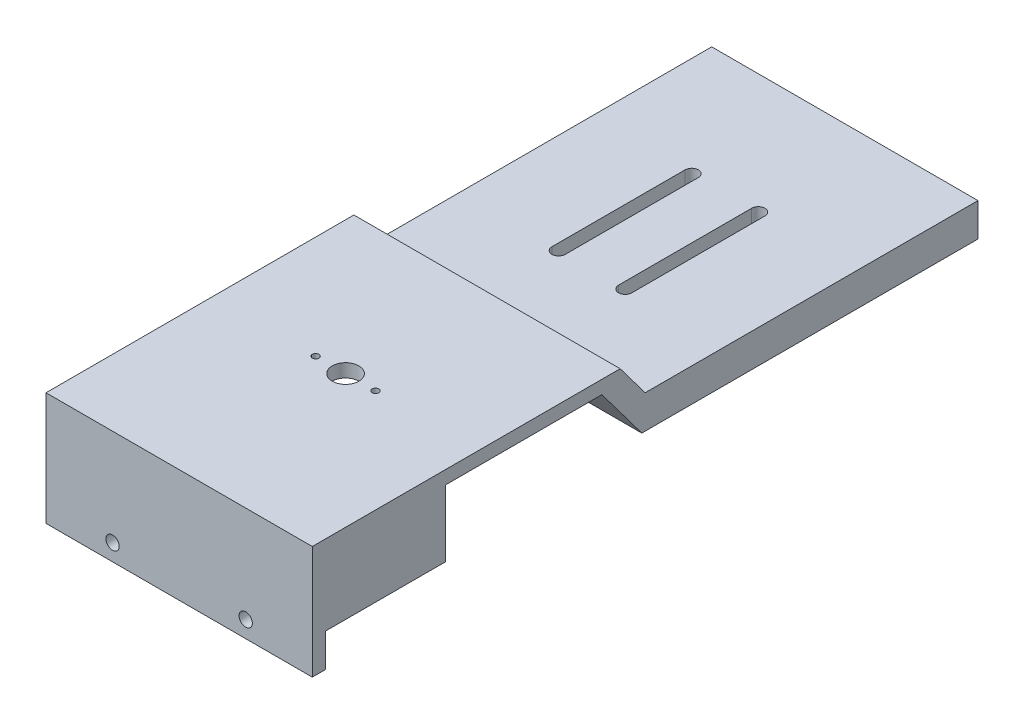
ISO-10303-21;
HEADER;
FILE_DESCRIPTION(('STEP AP214'),'2;1');
FILE_NAME('part.step','',(''),(''),'','','');
FILE_SCHEMA(('AUTOMOTIVE_DESIGN { 1 0 10303 214 1 1 1 1 }'));
ENDSEC;
DATA;
#1=APPLICATION_CONTEXT('core data for automotive mechanical design processes');
#2=APPLICATION_PROTOCOL_DEFINITION('international standard','automotive_design',2000,#1);
#3=PRODUCT_CONTEXT('',#1,'mechanical');
#4=PRODUCT('Part','Part','',(#3));
#5=PRODUCT_RELATED_PRODUCT_CATEGORY('part','',(#4));
#6=PRODUCT_DEFINITION_FORMATION('','',#4);
#7=PRODUCT_DEFINITION_CONTEXT('part definition',#1,'design');
#8=PRODUCT_DEFINITION('design','',#6,#7);
#9=PRODUCT_DEFINITION_SHAPE('','',#8);
#10=(LENGTH_UNIT() NAMED_UNIT(*) SI_UNIT(.MILLI.,.METRE.));
#11=(NAMED_UNIT(*) PLANE_ANGLE_UNIT() SI_UNIT($,.RADIAN.));
#12=(NAMED_UNIT(*) SI_UNIT($,.STERADIAN.) SOLID_ANGLE_UNIT());
#13=UNCERTAINTY_MEASURE_WITH_UNIT(LENGTH_MEASURE(1.E-05),#10,'distance_accuracy_value','');
#14=(GEOMETRIC_REPRESENTATION_CONTEXT(3) GLOBAL_UNCERTAINTY_ASSIGNED_CONTEXT((#13)) GLOBAL_UNIT_ASSIGNED_CONTEXT((#10,
#11,#12)) REPRESENTATION_CONTEXT('',''));
#15=CARTESIAN_POINT('',(0.,0.,0.));
#16=DIRECTION('',(0.,0.,1.));
#17=DIRECTION('',(1.,0.,0.));
#18=AXIS2_PLACEMENT_3D('',#15,#16,#17);
#19=CARTESIAN_POINT('',(-20.,-6.,20.));
#20=DIRECTION('',(0.,1.,0.));
#21=DIRECTION('',(0.,0.,1.));
#22=AXIS2_PLACEMENT_3D('',#19,#20,#21);
#23=PLANE('',#22);
#24=DIRECTION('',(1.,0.,0.));
#25=VECTOR('',#24,1.);
#26=CARTESIAN_POINT('',(-20.,-6.,18.));
#27=LINE('',#26,#25);
#28=CARTESIAN_POINT('',(-20.,-6.,18.));
#29=VERTEX_POINT('',#28);
#30=CARTESIAN_POINT('',(20.,-6.,18.));
#31=VERTEX_POINT('',#30);
#32=EDGE_CURVE('E346',#29,#31,#27,.T.);
#33=ORIENTED_EDGE('',*,*,#32,.F.);
#34=DIRECTION('',(0.,0.,-1.));
#35=VECTOR('',#34,1.);
#36=CARTESIAN_POINT('',(-20.,-6.,20.));
#37=LINE('',#36,#35);
#38=CARTESIAN_POINT('',(-20.,-6.,0.));
#39=VERTEX_POINT('',#38);
#40=EDGE_CURVE('E428',#29,#39,#37,.T.);
#41=ORIENTED_EDGE('',*,*,#40,.T.);
#42=DIRECTION('',(1.,0.,0.));
#43=VECTOR('',#42,1.);
#44=CARTESIAN_POINT('',(-20.,-6.,0.));
#45=LINE('',#44,#43);
#46=CARTESIAN_POINT('',(20.,-6.,0.));
#47=VERTEX_POINT('',#46);
#48=EDGE_CURVE('E409',#39,#47,#45,.T.);
#49=ORIENTED_EDGE('',*,*,#48,.T.);
#50=DIRECTION('',(0.,0.,-1.));
#51=VECTOR('',#50,1.);
#52=CARTESIAN_POINT('',(20.,-6.,20.));
#53=LINE('',#52,#51);
#54=EDGE_CURVE('E415',#31,#47,#53,.T.);
#55=ORIENTED_EDGE('',*,*,#54,.F.);
#56=EDGE_LOOP('',(#33,#41,#49,#55));
#57=FACE_BOUND('',#56,.T.);
#58=ADVANCED_FACE('F40',(#57),#23,.F.);
#59=CARTESIAN_POINT('',(0.,0.,0.));
#60=DIRECTION('',(0.,0.,1.));
#61=DIRECTION('',(1.,0.,0.));
#62=AXIS2_PLACEMENT_3D('',#59,#60,#61);
#63=PLANE('',#62);
#64=DIRECTION('',(-1.,0.,0.));
#65=VECTOR('',#64,1.);
#66=CARTESIAN_POINT('',(20.,4.,0.));
#67=LINE('',#66,#65);
#68=CARTESIAN_POINT('',(20.,4.,0.));
#69=VERTEX_POINT('',#68);
#70=CARTESIAN_POINT('',(-20.,4.,0.));
#71=VERTEX_POINT('',#70);
#72=EDGE_CURVE('E387',#69,#71,#67,.T.);
#73=ORIENTED_EDGE('',*,*,#72,.F.);
#74=DIRECTION('',(0.,1.,0.));
#75=VECTOR('',#74,1.);
#76=CARTESIAN_POINT('',(20.,6.,0.));
#77=LINE('',#76,#75);
#78=EDGE_CURVE('E403',#47,#69,#77,.T.);
#79=ORIENTED_EDGE('',*,*,#78,.F.);
#80=ORIENTED_EDGE('',*,*,#48,.F.);
#81=DIRECTION('',(0.,-1.,0.));
#82=VECTOR('',#81,1.);
#83=CARTESIAN_POINT('',(-20.,6.,0.));
#84=LINE('',#83,#82);
#85=EDGE_CURVE('E419',#71,#39,#84,.T.);
#86=ORIENTED_EDGE('',*,*,#85,.F.);
#87=EDGE_LOOP('',(#73,#79,#80,#86));
#88=FACE_BOUND('',#87,.T.);
#89=ADVANCED_FACE('F471',(#88),#63,.F.);
#90=CARTESIAN_POINT('',(20.,6.,20.));
#91=DIRECTION('',(-1.,0.,0.));
#92=DIRECTION('',(0.,-1.,0.));
#93=AXIS2_PLACEMENT_3D('',#90,#91,#92);
#94=PLANE('',#93);
#95=DIRECTION('',(0.,0.,-1.));
#96=VECTOR('',#95,1.);
#97=CARTESIAN_POINT('',(20.,0.999999999999989,-80.));
#98=LINE('',#97,#96);
#99=CARTESIAN_POINT('',(20.,0.999999999999989,-30.));
#100=VERTEX_POINT('',#99);
#101=CARTESIAN_POINT('',(20.,0.999999999999973,-80.));
#102=VERTEX_POINT('',#101);
#103=EDGE_CURVE('E270',#100,#102,#98,.T.);
#104=ORIENTED_EDGE('',*,*,#103,.F.);
#105=DIRECTION('',(0.,-0.800000000000001,-0.599999999999999));
#106=VECTOR('',#105,1.);
#107=CARTESIAN_POINT('',(20.,0.999999999999969,-30.));
#108=LINE('',#107,#106);
#109=CARTESIAN_POINT('',(20.,6.,-26.25));
#110=VERTEX_POINT('',#109);
#111=EDGE_CURVE('E273',#110,#100,#108,.T.);
#112=ORIENTED_EDGE('',*,*,#111,.F.);
#113=DIRECTION('',(0.,0.,-1.));
#114=VECTOR('',#113,1.);
#115=CARTESIAN_POINT('',(20.,6.,20.));
#116=LINE('',#115,#114);
#117=CARTESIAN_POINT('',(20.,6.,20.));
#118=VERTEX_POINT('',#117);
#119=EDGE_CURVE('E11',#118,#110,#116,.T.);
#120=ORIENTED_EDGE('',*,*,#119,.F.);
#121=DIRECTION('',(0.,1.,0.));
#122=VECTOR('',#121,1.);
#123=CARTESIAN_POINT('',(20.,6.,20.));
#124=LINE('',#123,#122);
#125=CARTESIAN_POINT('',(20.,-11.,20.));
#126=VERTEX_POINT('',#125);
#127=EDGE_CURVE('E404',#126,#118,#124,.T.);
#128=ORIENTED_EDGE('',*,*,#127,.F.);
#129=DIRECTION('',(0.,0.,1.));
#130=VECTOR('',#129,1.);
#131=CARTESIAN_POINT('',(20.,-11.,20.));
#132=LINE('',#131,#130);
#133=CARTESIAN_POINT('',(20.,-11.,18.));
#134=VERTEX_POINT('',#133);
#135=EDGE_CURVE('E368',#134,#126,#132,.T.);
#136=ORIENTED_EDGE('',*,*,#135,.F.);
#137=DIRECTION('',(0.,1.,0.));
#138=VECTOR('',#137,1.);
#139=CARTESIAN_POINT('',(20.,-11.,18.));
#140=LINE('',#139,#138);
#141=EDGE_CURVE('E376',#134,#31,#140,.T.);
#142=ORIENTED_EDGE('',*,*,#141,.T.);
#143=ORIENTED_EDGE('',*,*,#54,.T.);
#144=ORIENTED_EDGE('',*,*,#78,.T.);
#145=DIRECTION('',(0.,0.,1.));
#146=VECTOR('',#145,1.);
#147=CARTESIAN_POINT('',(20.,4.,-23.5));
#148=LINE('',#147,#146);
#149=CARTESIAN_POINT('',(20.,4.,-23.5));
#150=VERTEX_POINT('',#149);
#151=EDGE_CURVE('E399',#150,#69,#148,.T.);
#152=ORIENTED_EDGE('',*,*,#151,.F.);
#153=DIRECTION('',(0.,-0.8,-0.6));
#154=VECTOR('',#153,1.);
#155=CARTESIAN_POINT('',(20.,4.,-23.5));
#156=LINE('',#155,#154);
#157=CARTESIAN_POINT('',(20.,-4.,-29.5));
#158=VERTEX_POINT('',#157);
#159=EDGE_CURVE('E277',#150,#158,#156,.T.);
#160=ORIENTED_EDGE('',*,*,#159,.T.);
#161=DIRECTION('',(0.,0.,-1.));
#162=VECTOR('',#161,1.);
#163=CARTESIAN_POINT('',(20.,-4.,-29.5));
#164=LINE('',#163,#162);
#165=CARTESIAN_POINT('',(20.,-4.,-80.));
#166=VERTEX_POINT('',#165);
#167=EDGE_CURVE('E304',#158,#166,#164,.T.);
#168=ORIENTED_EDGE('',*,*,#167,.T.);
#169=DIRECTION('',(0.,1.,0.));
#170=VECTOR('',#169,1.);
#171=CARTESIAN_POINT('',(20.,6.,-80.));
#172=LINE('',#171,#170);
#173=EDGE_CURVE('E308',#166,#102,#172,.T.);
#174=ORIENTED_EDGE('',*,*,#173,.T.);
#175=EDGE_LOOP('',(#104,#112,#120,#128,#136,#142,#143,#144,#152,#160,#168,#174));
#176=FACE_BOUND('',#175,.T.);
#177=ADVANCED_FACE('F42',(#176),#94,.F.);
#178=CARTESIAN_POINT('',(-20.,6.,20.));
#179=DIRECTION('',(0.,-1.,0.));
#180=DIRECTION('',(0.,0.,-1.));
#181=AXIS2_PLACEMENT_3D('',#178,#179,#180);
#182=PLANE('',#181);
#183=CARTESIAN_POINT('',(-4.5,6.,-5.));
#184=DIRECTION('',(0.,1.,0.));
#185=DIRECTION('',(0.,0.,1.));
#186=AXIS2_PLACEMENT_3D('',#183,#184,#185);
#187=CIRCLE('',#186,0.500000000000001);
#188=CARTESIAN_POINT('',(-4.5,6.,-4.5));
#189=VERTEX_POINT('',#188);
#190=EDGE_CURVE('E337',#189,#189,#187,.T.);
#191=ORIENTED_EDGE('',*,*,#190,.F.);
#192=EDGE_LOOP('',(#191));
#193=FACE_BOUND('',#192,.T.);
#194=CARTESIAN_POINT('',(4.49999999999996,6.,-5.00000000000003));
#195=DIRECTION('',(0.,1.,0.));
#196=DIRECTION('',(0.,0.,-1.));
#197=AXIS2_PLACEMENT_3D('',#194,#195,#196);
#198=CIRCLE('',#197,0.5);
#199=CARTESIAN_POINT('',(4.49999999999996,6.,-5.50000000000003));
#200=VERTEX_POINT('',#199);
#201=EDGE_CURVE('E347',#200,#200,#198,.T.);
#202=ORIENTED_EDGE('',*,*,#201,.F.);
#203=EDGE_LOOP('',(#202));
#204=FACE_BOUND('',#203,.T.);
#205=CARTESIAN_POINT('',(0.,6.,-5.00000000000002));
#206=DIRECTION('',(0.,1.,0.));
#207=DIRECTION('',(0.,0.,1.));
#208=AXIS2_PLACEMENT_3D('',#205,#206,#207);
#209=CIRCLE('',#208,2.);
#210=CARTESIAN_POINT('',(0.,6.,-3.00000000000002));
#211=VERTEX_POINT('',#210);
#212=EDGE_CURVE('E325',#211,#211,#209,.T.);
#213=ORIENTED_EDGE('',*,*,#212,.F.);
#214=EDGE_LOOP('',(#213));
#215=FACE_BOUND('',#214,.T.);
#216=ORIENTED_EDGE('',*,*,#119,.T.);
#217=DIRECTION('',(-1.,0.,0.));
#218=VECTOR('',#217,1.);
#219=CARTESIAN_POINT('',(73.982057204223,5.99999999999997,-26.25));
#220=LINE('',#219,#218);
#221=CARTESIAN_POINT('',(-20.,6.,-26.25));
#222=VERTEX_POINT('',#221);
#223=EDGE_CURVE('E274',#110,#222,#220,.T.);
#224=ORIENTED_EDGE('',*,*,#223,.T.);
#225=DIRECTION('',(0.,0.,-1.));
#226=VECTOR('',#225,1.);
#227=CARTESIAN_POINT('',(-20.,6.,20.));
#228=LINE('',#227,#226);
#229=CARTESIAN_POINT('',(-20.,6.,20.));
#230=VERTEX_POINT('',#229);
#231=EDGE_CURVE('E49',#230,#222,#228,.T.);
#232=ORIENTED_EDGE('',*,*,#231,.F.);
#233=DIRECTION('',(-1.,0.,0.));
#234=VECTOR('',#233,1.);
#235=CARTESIAN_POINT('',(-20.,6.,20.));
#236=LINE('',#235,#234);
#237=EDGE_CURVE('E408',#118,#230,#236,.T.);
#238=ORIENTED_EDGE('',*,*,#237,.F.);
#239=EDGE_LOOP('',(#216,#224,#232,#238));
#240=FACE_BOUND('',#239,.T.);
#241=ADVANCED_FACE('F440',(#193,#204,#215,#240),#182,.F.);
#242=CARTESIAN_POINT('',(-20.,6.,20.));
#243=DIRECTION('',(1.,0.,0.));
#244=DIRECTION('',(0.,1.,0.));
#245=AXIS2_PLACEMENT_3D('',#242,#243,#244);
#246=PLANE('',#245);
#247=ORIENTED_EDGE('',*,*,#231,.T.);
#248=DIRECTION('',(0.,0.800000000000001,0.599999999999999));
#249=VECTOR('',#248,1.);
#250=CARTESIAN_POINT('',(-20.,1.,-30.));
#251=LINE('',#250,#249);
#252=CARTESIAN_POINT('',(-20.,1.,-30.));
#253=VERTEX_POINT('',#252);
#254=EDGE_CURVE('E281',#253,#222,#251,.T.);
#255=ORIENTED_EDGE('',*,*,#254,.F.);
#256=DIRECTION('',(0.,0.,1.));
#257=VECTOR('',#256,1.);
#258=CARTESIAN_POINT('',(-20.,1.,-80.));
#259=LINE('',#258,#257);
#260=CARTESIAN_POINT('',(-20.,1.,-80.));
#261=VERTEX_POINT('',#260);
#262=EDGE_CURVE('E186',#261,#253,#259,.T.);
#263=ORIENTED_EDGE('',*,*,#262,.F.);
#264=DIRECTION('',(0.,-1.,0.));
#265=VECTOR('',#264,1.);
#266=CARTESIAN_POINT('',(-20.,5.99999999999996,-80.));
#267=LINE('',#266,#265);
#268=CARTESIAN_POINT('',(-20.,-4.00000000000001,-80.));
#269=VERTEX_POINT('',#268);
#270=EDGE_CURVE('E296',#261,#269,#267,.T.);
#271=ORIENTED_EDGE('',*,*,#270,.T.);
#272=DIRECTION('',(0.,0.,1.));
#273=VECTOR('',#272,1.);
#274=CARTESIAN_POINT('',(-20.,-4.00000000000001,-29.5));
#275=LINE('',#274,#273);
#276=CARTESIAN_POINT('',(-20.,-4.00000000000001,-29.5));
#277=VERTEX_POINT('',#276);
#278=EDGE_CURVE('E293',#269,#277,#275,.T.);
#279=ORIENTED_EDGE('',*,*,#278,.T.);
#280=DIRECTION('',(0.,0.8,0.6));
#281=VECTOR('',#280,1.);
#282=CARTESIAN_POINT('',(-20.,3.99999999999997,-23.5));
#283=LINE('',#282,#281);
#284=CARTESIAN_POINT('',(-20.,4.,-23.5));
#285=VERTEX_POINT('',#284);
#286=EDGE_CURVE('E300',#277,#285,#283,.T.);
#287=ORIENTED_EDGE('',*,*,#286,.T.);
#288=DIRECTION('',(0.,0.,1.));
#289=VECTOR('',#288,1.);
#290=CARTESIAN_POINT('',(-20.,4.,-23.5));
#291=LINE('',#290,#289);
#292=EDGE_CURVE('E392',#285,#71,#291,.T.);
#293=ORIENTED_EDGE('',*,*,#292,.T.);
#294=ORIENTED_EDGE('',*,*,#85,.T.);
#295=ORIENTED_EDGE('',*,*,#40,.F.);
#296=DIRECTION('',(0.,1.,0.));
#297=VECTOR('',#296,1.);
#298=CARTESIAN_POINT('',(-20.,-11.,18.));
#299=LINE('',#298,#297);
#300=CARTESIAN_POINT('',(-20.,-11.,18.));
#301=VERTEX_POINT('',#300);
#302=EDGE_CURVE('E383',#301,#29,#299,.T.);
#303=ORIENTED_EDGE('',*,*,#302,.F.);
#304=DIRECTION('',(0.,0.,-1.));
#305=VECTOR('',#304,1.);
#306=CARTESIAN_POINT('',(-20.,-11.,20.));
#307=LINE('',#306,#305);
#308=CARTESIAN_POINT('',(-20.,-11.,20.));
#309=VERTEX_POINT('',#308);
#310=EDGE_CURVE('E361',#309,#301,#307,.T.);
#311=ORIENTED_EDGE('',*,*,#310,.F.);
#312=DIRECTION('',(0.,-1.,0.));
#313=VECTOR('',#312,1.);
#314=CARTESIAN_POINT('',(-20.,6.,20.));
#315=LINE('',#314,#313);
#316=EDGE_CURVE('E412',#230,#309,#315,.T.);
#317=ORIENTED_EDGE('',*,*,#316,.F.);
#318=EDGE_LOOP('',(#247,#255,#263,#271,#279,#287,#293,#294,#295,#303,#311,#317));
#319=FACE_BOUND('',#318,.T.);
#320=ADVANCED_FACE('F436',(#319),#246,.F.);
#321=CARTESIAN_POINT('',(0.,0.,20.));
#322=DIRECTION('',(0.,0.,1.));
#323=DIRECTION('',(1.,0.,0.));
#324=AXIS2_PLACEMENT_3D('',#321,#322,#323);
#325=PLANE('',#324);
#326=CARTESIAN_POINT('',(10.,-8.5,20.));
#327=DIRECTION('',(0.,0.,1.));
#328=DIRECTION('',(1.,0.,0.));
#329=AXIS2_PLACEMENT_3D('',#326,#327,#328);
#330=CIRCLE('',#329,1.);
#331=CARTESIAN_POINT('',(11.,-8.5,20.));
#332=VERTEX_POINT('',#331);
#333=EDGE_CURVE('E326',#332,#332,#330,.F.);
#334=ORIENTED_EDGE('',*,*,#333,.T.);
#335=EDGE_LOOP('',(#334));
#336=FACE_BOUND('',#335,.T.);
#337=CARTESIAN_POINT('',(-10.0000000000001,-8.49999999999993,20.));
#338=DIRECTION('',(0.,0.,1.));
#339=DIRECTION('',(1.,0.,0.));
#340=AXIS2_PLACEMENT_3D('',#337,#338,#339);
#341=CIRCLE('',#340,1.);
#342=CARTESIAN_POINT('',(-9.00000000000006,-8.49999999999993,20.));
#343=VERTEX_POINT('',#342);
#344=EDGE_CURVE('E320',#343,#343,#341,.F.);
#345=ORIENTED_EDGE('',*,*,#344,.T.);
#346=EDGE_LOOP('',(#345));
#347=FACE_BOUND('',#346,.T.);
#348=ORIENTED_EDGE('',*,*,#127,.T.);
#349=ORIENTED_EDGE('',*,*,#237,.T.);
#350=ORIENTED_EDGE('',*,*,#316,.T.);
#351=DIRECTION('',(-1.,0.,0.));
#352=VECTOR('',#351,1.);
#353=CARTESIAN_POINT('',(-20.,-11.,20.));
#354=LINE('',#353,#352);
#355=EDGE_CURVE('E372',#126,#309,#354,.T.);
#356=ORIENTED_EDGE('',*,*,#355,.F.);
#357=EDGE_LOOP('',(#348,#349,#350,#356));
#358=FACE_BOUND('',#357,.T.);
#359=ADVANCED_FACE('F482',(#336,#347,#358),#325,.T.);
#360=CARTESIAN_POINT('',(20.,4.,-23.5));
#361=DIRECTION('',(0.,1.,0.));
#362=DIRECTION('',(0.,0.,1.));
#363=AXIS2_PLACEMENT_3D('',#360,#361,#362);
#364=PLANE('',#363);
#365=CARTESIAN_POINT('',(-4.5,4.,-5.));
#366=DIRECTION('',(0.,1.,0.));
#367=DIRECTION('',(0.,0.,1.));
#368=AXIS2_PLACEMENT_3D('',#365,#366,#367);
#369=CIRCLE('',#368,0.500000000000001);
#370=CARTESIAN_POINT('',(-4.5,4.,-4.5));
#371=VERTEX_POINT('',#370);
#372=EDGE_CURVE('E341',#371,#371,#369,.F.);
#373=ORIENTED_EDGE('',*,*,#372,.F.);
#374=EDGE_LOOP('',(#373));
#375=FACE_BOUND('',#374,.T.);
#376=CARTESIAN_POINT('',(4.49999999999996,4.,-5.00000000000003));
#377=DIRECTION('',(0.,1.,0.));
#378=DIRECTION('',(0.,0.,1.));
#379=AXIS2_PLACEMENT_3D('',#376,#377,#378);
#380=CIRCLE('',#379,0.5);
#381=CARTESIAN_POINT('',(4.49999999999996,4.,-4.50000000000003));
#382=VERTEX_POINT('',#381);
#383=EDGE_CURVE('E342',#382,#382,#380,.F.);
#384=ORIENTED_EDGE('',*,*,#383,.F.);
#385=EDGE_LOOP('',(#384));
#386=FACE_BOUND('',#385,.T.);
#387=CARTESIAN_POINT('',(0.,4.,-5.00000000000002));
#388=DIRECTION('',(0.,1.,0.));
#389=DIRECTION('',(0.,0.,1.));
#390=AXIS2_PLACEMENT_3D('',#387,#388,#389);
#391=CIRCLE('',#390,2.);
#392=CARTESIAN_POINT('',(0.,4.,-3.00000000000002));
#393=VERTEX_POINT('',#392);
#394=EDGE_CURVE('E351',#393,#393,#391,.F.);
#395=ORIENTED_EDGE('',*,*,#394,.F.);
#396=EDGE_LOOP('',(#395));
#397=FACE_BOUND('',#396,.T.);
#398=ORIENTED_EDGE('',*,*,#72,.T.);
#399=ORIENTED_EDGE('',*,*,#292,.F.);
#400=DIRECTION('',(-1.,0.,0.));
#401=VECTOR('',#400,1.);
#402=CARTESIAN_POINT('',(20.,4.,-23.5));
#403=LINE('',#402,#401);
#404=EDGE_CURVE('E388',#150,#285,#403,.T.);
#405=ORIENTED_EDGE('',*,*,#404,.F.);
#406=ORIENTED_EDGE('',*,*,#151,.T.);
#407=EDGE_LOOP('',(#398,#399,#405,#406));
#408=FACE_BOUND('',#407,.T.);
#409=ADVANCED_FACE('F467',(#375,#386,#397,#408),#364,.F.);
#410=CARTESIAN_POINT('',(-20.,-11.,18.));
#411=DIRECTION('',(0.,0.,1.));
#412=DIRECTION('',(1.,0.,0.));
#413=AXIS2_PLACEMENT_3D('',#410,#411,#412);
#414=PLANE('',#413);
#415=CARTESIAN_POINT('',(10.,-8.5,18.));
#416=DIRECTION('',(0.,0.,-1.));
#417=DIRECTION('',(-1.,0.,0.));
#418=AXIS2_PLACEMENT_3D('',#415,#416,#417);
#419=CIRCLE('',#418,1.);
#420=CARTESIAN_POINT('',(9.,-8.5,18.));
#421=VERTEX_POINT('',#420);
#422=EDGE_CURVE('E321',#421,#421,#419,.T.);
#423=ORIENTED_EDGE('',*,*,#422,.F.);
#424=EDGE_LOOP('',(#423));
#425=FACE_BOUND('',#424,.T.);
#426=CARTESIAN_POINT('',(-10.0000000000001,-8.49999999999993,18.));
#427=DIRECTION('',(0.,0.,-1.));
#428=DIRECTION('',(1.,0.,0.));
#429=AXIS2_PLACEMENT_3D('',#426,#427,#428);
#430=CIRCLE('',#429,1.);
#431=CARTESIAN_POINT('',(-9.00000000000006,-8.49999999999993,18.));
#432=VERTEX_POINT('',#431);
#433=EDGE_CURVE('E330',#432,#432,#430,.T.);
#434=ORIENTED_EDGE('',*,*,#433,.F.);
#435=EDGE_LOOP('',(#434));
#436=FACE_BOUND('',#435,.T.);
#437=ORIENTED_EDGE('',*,*,#32,.T.);
#438=ORIENTED_EDGE('',*,*,#141,.F.);
#439=DIRECTION('',(1.,0.,0.));
#440=VECTOR('',#439,1.);
#441=CARTESIAN_POINT('',(-20.,-11.,18.));
#442=LINE('',#441,#440);
#443=EDGE_CURVE('E365',#301,#134,#442,.T.);
#444=ORIENTED_EDGE('',*,*,#443,.F.);
#445=ORIENTED_EDGE('',*,*,#302,.T.);
#446=EDGE_LOOP('',(#437,#438,#444,#445));
#447=FACE_BOUND('',#446,.T.);
#448=ADVANCED_FACE('F477',(#425,#436,#447),#414,.F.);
#449=CARTESIAN_POINT('',(0.,-11.,0.));
#450=DIRECTION('',(0.,-1.,0.));
#451=DIRECTION('',(0.,0.,-1.));
#452=AXIS2_PLACEMENT_3D('',#449,#450,#451);
#453=PLANE('',#452);
#454=ORIENTED_EDGE('',*,*,#310,.T.);
#455=ORIENTED_EDGE('',*,*,#443,.T.);
#456=ORIENTED_EDGE('',*,*,#135,.T.);
#457=ORIENTED_EDGE('',*,*,#355,.T.);
#458=EDGE_LOOP('',(#454,#455,#456,#457));
#459=FACE_BOUND('',#458,.T.);
#460=ADVANCED_FACE('F479',(#459),#453,.T.);
#461=CARTESIAN_POINT('',(0.,-11.001,-5.00000000000002));
#462=DIRECTION('',(0.,1.,0.));
#463=DIRECTION('',(0.,0.,1.));
#464=AXIS2_PLACEMENT_3D('',#461,#462,#463);
#465=CYLINDRICAL_SURFACE('',#464,2.);
#466=ORIENTED_EDGE('',*,*,#212,.T.);
#467=EDGE_LOOP('',(#466));
#468=FACE_BOUND('',#467,.T.);
#469=ORIENTED_EDGE('',*,*,#394,.T.);
#470=EDGE_LOOP('',(#469));
#471=FACE_BOUND('',#470,.T.);
#472=ADVANCED_FACE('F512',(#468,#471),#465,.F.);
#473=CARTESIAN_POINT('',(4.49999999999996,-11.001,-5.00000000000003));
#474=DIRECTION('',(0.,1.,0.));
#475=DIRECTION('',(0.,0.,1.));
#476=AXIS2_PLACEMENT_3D('',#473,#474,#475);
#477=CYLINDRICAL_SURFACE('',#476,0.5);
#478=ORIENTED_EDGE('',*,*,#201,.T.);
#479=EDGE_LOOP('',(#478));
#480=FACE_BOUND('',#479,.T.);
#481=ORIENTED_EDGE('',*,*,#383,.T.);
#482=EDGE_LOOP('',(#481));
#483=FACE_BOUND('',#482,.T.);
#484=ADVANCED_FACE('F515',(#480,#483),#477,.F.);
#485=CARTESIAN_POINT('',(-4.5,-11.001,-5.));
#486=DIRECTION('',(0.,1.,0.));
#487=DIRECTION('',(0.,0.,1.));
#488=AXIS2_PLACEMENT_3D('',#485,#486,#487);
#489=CYLINDRICAL_SURFACE('',#488,0.500000000000001);
#490=ORIENTED_EDGE('',*,*,#190,.T.);
#491=EDGE_LOOP('',(#490));
#492=FACE_BOUND('',#491,.T.);
#493=ORIENTED_EDGE('',*,*,#372,.T.);
#494=EDGE_LOOP('',(#493));
#495=FACE_BOUND('',#494,.T.);
#496=ADVANCED_FACE('F523',(#492,#495),#489,.F.);
#497=CARTESIAN_POINT('',(-10.0000000000001,-8.49999999999993,20.001));
#498=DIRECTION('',(0.,0.,-1.));
#499=DIRECTION('',(-1.,0.,0.));
#500=AXIS2_PLACEMENT_3D('',#497,#498,#499);
#501=CYLINDRICAL_SURFACE('',#500,1.);
#502=ORIENTED_EDGE('',*,*,#344,.F.);
#503=EDGE_LOOP('',(#502));
#504=FACE_BOUND('',#503,.T.);
#505=ORIENTED_EDGE('',*,*,#433,.T.);
#506=EDGE_LOOP('',(#505));
#507=FACE_BOUND('',#506,.T.);
#508=ADVANCED_FACE('F537',(#504,#507),#501,.F.);
#509=CARTESIAN_POINT('',(10.,-8.5,20.001));
#510=DIRECTION('',(0.,0.,-1.));
#511=DIRECTION('',(-1.,0.,0.));
#512=AXIS2_PLACEMENT_3D('',#509,#510,#511);
#513=CYLINDRICAL_SURFACE('',#512,1.);
#514=ORIENTED_EDGE('',*,*,#333,.F.);
#515=EDGE_LOOP('',(#514));
#516=FACE_BOUND('',#515,.T.);
#517=ORIENTED_EDGE('',*,*,#422,.T.);
#518=EDGE_LOOP('',(#517));
#519=FACE_BOUND('',#518,.T.);
#520=ADVANCED_FACE('F539',(#516,#519),#513,.F.);
#521=CARTESIAN_POINT('',(-77.3781317228088,5.99999999999997,-80.));
#522=DIRECTION('',(0.,0.,-1.));
#523=DIRECTION('',(-1.,0.,0.));
#524=AXIS2_PLACEMENT_3D('',#521,#522,#523);
#525=PLANE('',#524);
#526=DIRECTION('',(-1.,0.,0.));
#527=VECTOR('',#526,1.);
#528=CARTESIAN_POINT('',(73.982057204223,0.999999999999974,-80.));
#529=LINE('',#528,#527);
#530=EDGE_CURVE('E284',#102,#261,#529,.T.);
#531=ORIENTED_EDGE('',*,*,#530,.F.);
#532=ORIENTED_EDGE('',*,*,#173,.F.);
#533=DIRECTION('',(1.,0.,0.));
#534=VECTOR('',#533,1.);
#535=CARTESIAN_POINT('',(-77.3781317228088,-4.00000000000003,-80.));
#536=LINE('',#535,#534);
#537=EDGE_CURVE('E297',#269,#166,#536,.T.);
#538=ORIENTED_EDGE('',*,*,#537,.F.);
#539=ORIENTED_EDGE('',*,*,#270,.F.);
#540=EDGE_LOOP('',(#531,#532,#538,#539));
#541=FACE_BOUND('',#540,.T.);
#542=ADVANCED_FACE('F454',(#541),#525,.T.);
#543=CARTESIAN_POINT('',(-77.3781317228088,-4.00000000000003,-29.5));
#544=DIRECTION('',(0.,-1.,0.));
#545=DIRECTION('',(1.,0.,0.));
#546=AXIS2_PLACEMENT_3D('',#543,#544,#545);
#547=PLANE('',#546);
#548=CARTESIAN_POINT('',(-5.,-4.00000000000001,-62.));
#549=DIRECTION('',(0.,-1.,0.));
#550=DIRECTION('',(1.,0.,0.));
#551=AXIS2_PLACEMENT_3D('',#548,#549,#550);
#552=CIRCLE('',#551,1.);
#553=CARTESIAN_POINT('',(-4.,-4.00000000000001,-62.));
#554=VERTEX_POINT('',#553);
#555=CARTESIAN_POINT('',(-6.,-4.00000000000001,-62.));
#556=VERTEX_POINT('',#555);
#557=EDGE_CURVE('E191',#554,#556,#552,.F.);
#558=ORIENTED_EDGE('',*,*,#557,.T.);
#559=DIRECTION('',(0.,0.,1.));
#560=VECTOR('',#559,1.);
#561=CARTESIAN_POINT('',(-6.,-4.00000000000001,-62.));
#562=LINE('',#561,#560);
#563=CARTESIAN_POINT('',(-6.00000000000001,-4.00000000000001,-42.));
#564=VERTEX_POINT('',#563);
#565=EDGE_CURVE('E177',#556,#564,#562,.T.);
#566=ORIENTED_EDGE('',*,*,#565,.T.);
#567=CARTESIAN_POINT('',(-5.,-4.00000000000001,-42.));
#568=DIRECTION('',(0.,-1.,0.));
#569=DIRECTION('',(1.,0.,0.));
#570=AXIS2_PLACEMENT_3D('',#567,#568,#569);
#571=CIRCLE('',#570,1.);
#572=CARTESIAN_POINT('',(-4.,-4.00000000000001,-42.));
#573=VERTEX_POINT('',#572);
#574=EDGE_CURVE('E208',#564,#573,#571,.F.);
#575=ORIENTED_EDGE('',*,*,#574,.T.);
#576=DIRECTION('',(0.,0.,-1.));
#577=VECTOR('',#576,1.);
#578=CARTESIAN_POINT('',(-4.,-4.00000000000001,-62.));
#579=LINE('',#578,#577);
#580=EDGE_CURVE('E201',#573,#554,#579,.T.);
#581=ORIENTED_EDGE('',*,*,#580,.T.);
#582=EDGE_LOOP('',(#558,#566,#575,#581));
#583=FACE_BOUND('',#582,.T.);
#584=CARTESIAN_POINT('',(5.00000000000011,-4.,-62.));
#585=DIRECTION('',(0.,-1.,0.));
#586=DIRECTION('',(1.,0.,0.));
#587=AXIS2_PLACEMENT_3D('',#584,#585,#586);
#588=CIRCLE('',#587,1.);
#589=CARTESIAN_POINT('',(6.00000000000011,-4.,-62.));
#590=VERTEX_POINT('',#589);
#591=CARTESIAN_POINT('',(4.00000000000011,-4.,-62.));
#592=VERTEX_POINT('',#591);
#593=EDGE_CURVE('E236',#590,#592,#588,.F.);
#594=ORIENTED_EDGE('',*,*,#593,.T.);
#595=DIRECTION('',(0.,0.,1.));
#596=VECTOR('',#595,1.);
#597=CARTESIAN_POINT('',(4.00000000000011,-4.,-62.));
#598=LINE('',#597,#596);
#599=CARTESIAN_POINT('',(4.00000000000025,-4.,-42.));
#600=VERTEX_POINT('',#599);
#601=EDGE_CURVE('E258',#592,#600,#598,.T.);
#602=ORIENTED_EDGE('',*,*,#601,.T.);
#603=CARTESIAN_POINT('',(5.00000000000025,-4.,-42.));
#604=DIRECTION('',(0.,-1.,0.));
#605=DIRECTION('',(1.,0.,0.));
#606=AXIS2_PLACEMENT_3D('',#603,#604,#605);
#607=CIRCLE('',#606,1.);
#608=CARTESIAN_POINT('',(6.00000000000025,-4.,-42.));
#609=VERTEX_POINT('',#608);
#610=EDGE_CURVE('E228',#600,#609,#607,.F.);
#611=ORIENTED_EDGE('',*,*,#610,.T.);
#612=DIRECTION('',(0.,0.,-1.));
#613=VECTOR('',#612,1.);
#614=CARTESIAN_POINT('',(6.00000000000011,-4.,-62.));
#615=LINE('',#614,#613);
#616=EDGE_CURVE('E232',#609,#590,#615,.T.);
#617=ORIENTED_EDGE('',*,*,#616,.T.);
#618=EDGE_LOOP('',(#594,#602,#611,#617));
#619=FACE_BOUND('',#618,.T.);
#620=ORIENTED_EDGE('',*,*,#278,.F.);
#621=ORIENTED_EDGE('',*,*,#537,.T.);
#622=ORIENTED_EDGE('',*,*,#167,.F.);
#623=DIRECTION('',(1.,0.,0.));
#624=VECTOR('',#623,1.);
#625=CARTESIAN_POINT('',(-77.3781317228088,-4.00000000000003,-29.5));
#626=LINE('',#625,#624);
#627=EDGE_CURVE('E312',#277,#158,#626,.T.);
#628=ORIENTED_EDGE('',*,*,#627,.F.);
#629=EDGE_LOOP('',(#620,#621,#622,#628));
#630=FACE_BOUND('',#629,.T.);
#631=ADVANCED_FACE('F199',(#583,#619,#630),#547,.T.);
#632=CARTESIAN_POINT('',(-77.3781317228088,3.99999999999997,-23.5));
#633=DIRECTION('',(0.,-0.6,0.8));
#634=DIRECTION('',(0.,-0.8,-0.6));
#635=AXIS2_PLACEMENT_3D('',#632,#633,#634);
#636=PLANE('',#635);
#637=ORIENTED_EDGE('',*,*,#286,.F.);
#638=ORIENTED_EDGE('',*,*,#627,.T.);
#639=ORIENTED_EDGE('',*,*,#159,.F.);
#640=ORIENTED_EDGE('',*,*,#404,.T.);
#641=EDGE_LOOP('',(#637,#638,#639,#640));
#642=FACE_BOUND('',#641,.T.);
#643=ADVANCED_FACE('F463',(#642),#636,.T.);
#644=CARTESIAN_POINT('',(73.982057204223,0.999999999999974,-30.));
#645=DIRECTION('',(0.,-0.599999999999999,0.800000000000001));
#646=DIRECTION('',(0.,-0.800000000000001,-0.599999999999999));
#647=AXIS2_PLACEMENT_3D('',#644,#645,#646);
#648=PLANE('',#647);
#649=ORIENTED_EDGE('',*,*,#111,.T.);
#650=DIRECTION('',(-1.,0.,0.));
#651=VECTOR('',#650,1.);
#652=CARTESIAN_POINT('',(73.982057204223,0.999999999999974,-30.));
#653=LINE('',#652,#651);
#654=EDGE_CURVE('E288',#100,#253,#653,.T.);
#655=ORIENTED_EDGE('',*,*,#654,.T.);
#656=ORIENTED_EDGE('',*,*,#254,.T.);
#657=ORIENTED_EDGE('',*,*,#223,.F.);
#658=EDGE_LOOP('',(#649,#655,#656,#657));
#659=FACE_BOUND('',#658,.T.);
#660=ADVANCED_FACE('F444',(#659),#648,.F.);
#661=CARTESIAN_POINT('',(73.982057204223,0.999999999999974,-80.));
#662=DIRECTION('',(0.,-1.,0.));
#663=DIRECTION('',(1.,0.,0.));
#664=AXIS2_PLACEMENT_3D('',#661,#662,#663);
#665=PLANE('',#664);
#666=DIRECTION('',(0.,0.,1.));
#667=VECTOR('',#666,1.);
#668=CARTESIAN_POINT('',(-6.,0.999999999999997,-62.));
#669=LINE('',#668,#667);
#670=CARTESIAN_POINT('',(-6.,0.999999999999997,-62.));
#671=VERTEX_POINT('',#670);
#672=CARTESIAN_POINT('',(-6.,0.999999999999997,-42.));
#673=VERTEX_POINT('',#672);
#674=EDGE_CURVE('E206',#671,#673,#669,.T.);
#675=ORIENTED_EDGE('',*,*,#674,.F.);
#676=CARTESIAN_POINT('',(-5.,0.999999999999997,-62.));
#677=DIRECTION('',(0.,1.,0.));
#678=DIRECTION('',(-1.,0.,0.));
#679=AXIS2_PLACEMENT_3D('',#676,#677,#678);
#680=CIRCLE('',#679,1.);
#681=CARTESIAN_POINT('',(-3.99999999999999,0.999999999999996,-62.));
#682=VERTEX_POINT('',#681);
#683=EDGE_CURVE('E194',#682,#671,#680,.T.);
#684=ORIENTED_EDGE('',*,*,#683,.F.);
#685=DIRECTION('',(0.,0.,-1.));
#686=VECTOR('',#685,1.);
#687=CARTESIAN_POINT('',(-3.99999999999999,0.999999999999996,-62.));
#688=LINE('',#687,#686);
#689=CARTESIAN_POINT('',(-3.99999999999999,0.999999999999996,-42.));
#690=VERTEX_POINT('',#689);
#691=EDGE_CURVE('E196',#690,#682,#688,.T.);
#692=ORIENTED_EDGE('',*,*,#691,.F.);
#693=CARTESIAN_POINT('',(-5.,0.999999999999997,-42.));
#694=DIRECTION('',(0.,1.,0.));
#695=DIRECTION('',(-1.,0.,0.));
#696=AXIS2_PLACEMENT_3D('',#693,#694,#695);
#697=CIRCLE('',#696,1.);
#698=EDGE_CURVE('E214',#673,#690,#697,.T.);
#699=ORIENTED_EDGE('',*,*,#698,.F.);
#700=EDGE_LOOP('',(#675,#684,#692,#699));
#701=FACE_BOUND('',#700,.T.);
#702=DIRECTION('',(0.,0.,1.));
#703=VECTOR('',#702,1.);
#704=CARTESIAN_POINT('',(4.00000000000011,0.999999999999994,-62.));
#705=LINE('',#704,#703);
#706=CARTESIAN_POINT('',(4.0000000000001,0.999999999999994,-62.));
#707=VERTEX_POINT('',#706);
#708=CARTESIAN_POINT('',(4.00000000000025,0.999999999999994,-42.));
#709=VERTEX_POINT('',#708);
#710=EDGE_CURVE('E243',#707,#709,#705,.T.);
#711=ORIENTED_EDGE('',*,*,#710,.F.);
#712=CARTESIAN_POINT('',(5.00000000000011,0.999999999999994,-62.));
#713=DIRECTION('',(0.,1.,0.));
#714=DIRECTION('',(1.,0.,0.));
#715=AXIS2_PLACEMENT_3D('',#712,#713,#714);
#716=CIRCLE('',#715,1.);
#717=CARTESIAN_POINT('',(6.00000000000011,0.999999999999993,-62.));
#718=VERTEX_POINT('',#717);
#719=EDGE_CURVE('E240',#718,#707,#716,.T.);
#720=ORIENTED_EDGE('',*,*,#719,.F.);
#721=DIRECTION('',(0.,0.,-1.));
#722=VECTOR('',#721,1.);
#723=CARTESIAN_POINT('',(6.00000000000011,0.999999999999993,-62.));
#724=LINE('',#723,#722);
#725=CARTESIAN_POINT('',(6.00000000000025,0.999999999999993,-42.));
#726=VERTEX_POINT('',#725);
#727=EDGE_CURVE('E250',#726,#718,#724,.T.);
#728=ORIENTED_EDGE('',*,*,#727,.F.);
#729=CARTESIAN_POINT('',(5.00000000000025,0.999999999999994,-42.));
#730=DIRECTION('',(0.,1.,0.));
#731=DIRECTION('',(1.,0.,0.));
#732=AXIS2_PLACEMENT_3D('',#729,#730,#731);
#733=CIRCLE('',#732,1.);
#734=EDGE_CURVE('E246',#709,#726,#733,.T.);
#735=ORIENTED_EDGE('',*,*,#734,.F.);
#736=EDGE_LOOP('',(#711,#720,#728,#735));
#737=FACE_BOUND('',#736,.T.);
#738=ORIENTED_EDGE('',*,*,#103,.T.);
#739=ORIENTED_EDGE('',*,*,#530,.T.);
#740=ORIENTED_EDGE('',*,*,#262,.T.);
#741=ORIENTED_EDGE('',*,*,#654,.F.);
#742=EDGE_LOOP('',(#738,#739,#740,#741));
#743=FACE_BOUND('',#742,.T.);
#744=ADVANCED_FACE('F451',(#701,#737,#743),#665,.F.);
#745=CARTESIAN_POINT('',(5.00000000000011,-11.001,-62.));
#746=DIRECTION('',(0.,1.,0.));
#747=DIRECTION('',(-1.,0.,0.));
#748=AXIS2_PLACEMENT_3D('',#745,#746,#747);
#749=CYLINDRICAL_SURFACE('',#748,1.);
#750=DIRECTION('',(0.,1.,0.));
#751=VECTOR('',#750,1.);
#752=CARTESIAN_POINT('',(6.00000000000011,-11.001,-62.));
#753=LINE('',#752,#751);
#754=EDGE_CURVE('E255',#590,#718,#753,.T.);
#755=ORIENTED_EDGE('',*,*,#754,.T.);
#756=ORIENTED_EDGE('',*,*,#719,.T.);
#757=DIRECTION('',(0.,1.,0.));
#758=VECTOR('',#757,1.);
#759=CARTESIAN_POINT('',(4.00000000000011,-11.001,-62.));
#760=LINE('',#759,#758);
#761=EDGE_CURVE('E254',#592,#707,#760,.T.);
#762=ORIENTED_EDGE('',*,*,#761,.F.);
#763=ORIENTED_EDGE('',*,*,#593,.F.);
#764=EDGE_LOOP('',(#755,#756,#762,#763));
#765=FACE_BOUND('',#764,.T.);
#766=ADVANCED_FACE('F559',(#765),#749,.F.);
#767=CARTESIAN_POINT('',(6.00000000000011,-11.001,-62.));
#768=DIRECTION('',(1.,0.,0.));
#769=DIRECTION('',(0.,0.,-1.));
#770=AXIS2_PLACEMENT_3D('',#767,#768,#769);
#771=PLANE('',#770);
#772=DIRECTION('',(0.,1.,0.));
#773=VECTOR('',#772,1.);
#774=CARTESIAN_POINT('',(6.00000000000025,-11.001,-42.));
#775=LINE('',#774,#773);
#776=EDGE_CURVE('E259',#609,#726,#775,.T.);
#777=ORIENTED_EDGE('',*,*,#776,.T.);
#778=ORIENTED_EDGE('',*,*,#727,.T.);
#779=ORIENTED_EDGE('',*,*,#754,.F.);
#780=ORIENTED_EDGE('',*,*,#616,.F.);
#781=EDGE_LOOP('',(#777,#778,#779,#780));
#782=FACE_BOUND('',#781,.T.);
#783=ADVANCED_FACE('F565',(#782),#771,.F.);
#784=CARTESIAN_POINT('',(5.00000000000025,-11.001,-42.));
#785=DIRECTION('',(0.,1.,0.));
#786=DIRECTION('',(-1.,0.,0.));
#787=AXIS2_PLACEMENT_3D('',#784,#785,#786);
#788=CYLINDRICAL_SURFACE('',#787,1.);
#789=DIRECTION('',(0.,1.,0.));
#790=VECTOR('',#789,1.);
#791=CARTESIAN_POINT('',(4.00000000000024,-11.001,-42.));
#792=LINE('',#791,#790);
#793=EDGE_CURVE('E64',#600,#709,#792,.T.);
#794=ORIENTED_EDGE('',*,*,#793,.T.);
#795=ORIENTED_EDGE('',*,*,#734,.T.);
#796=ORIENTED_EDGE('',*,*,#776,.F.);
#797=ORIENTED_EDGE('',*,*,#610,.F.);
#798=EDGE_LOOP('',(#794,#795,#796,#797));
#799=FACE_BOUND('',#798,.T.);
#800=ADVANCED_FACE('F570',(#799),#788,.F.);
#801=CARTESIAN_POINT('',(4.00000000000011,-11.001,-62.));
#802=DIRECTION('',(-1.,0.,0.));
#803=DIRECTION('',(0.,0.,1.));
#804=AXIS2_PLACEMENT_3D('',#801,#802,#803);
#805=PLANE('',#804);
#806=ORIENTED_EDGE('',*,*,#761,.T.);
#807=ORIENTED_EDGE('',*,*,#710,.T.);
#808=ORIENTED_EDGE('',*,*,#793,.F.);
#809=ORIENTED_EDGE('',*,*,#601,.F.);
#810=EDGE_LOOP('',(#806,#807,#808,#809));
#811=FACE_BOUND('',#810,.T.);
#812=ADVANCED_FACE('F567',(#811),#805,.F.);
#813=CARTESIAN_POINT('',(-5.,-11.001,-62.));
#814=DIRECTION('',(0.,1.,0.));
#815=DIRECTION('',(-1.,0.,0.));
#816=AXIS2_PLACEMENT_3D('',#813,#814,#815);
#817=CYLINDRICAL_SURFACE('',#816,1.);
#818=DIRECTION('',(0.,1.,0.));
#819=VECTOR('',#818,1.);
#820=CARTESIAN_POINT('',(-4.,-11.001,-62.));
#821=LINE('',#820,#819);
#822=EDGE_CURVE('E187',#554,#682,#821,.T.);
#823=ORIENTED_EDGE('',*,*,#822,.T.);
#824=ORIENTED_EDGE('',*,*,#683,.T.);
#825=DIRECTION('',(0.,1.,0.));
#826=VECTOR('',#825,1.);
#827=CARTESIAN_POINT('',(-6.,-11.001,-62.));
#828=LINE('',#827,#826);
#829=EDGE_CURVE('E180',#556,#671,#828,.T.);
#830=ORIENTED_EDGE('',*,*,#829,.F.);
#831=ORIENTED_EDGE('',*,*,#557,.F.);
#832=EDGE_LOOP('',(#823,#824,#830,#831));
#833=FACE_BOUND('',#832,.T.);
#834=ADVANCED_FACE('F190',(#833),#817,.F.);
#835=CARTESIAN_POINT('',(-4.,-11.001,-62.));
#836=DIRECTION('',(1.,0.,0.));
#837=DIRECTION('',(0.,1.,0.));
#838=AXIS2_PLACEMENT_3D('',#835,#836,#837);
#839=PLANE('',#838);
#840=DIRECTION('',(0.,1.,0.));
#841=VECTOR('',#840,1.);
#842=CARTESIAN_POINT('',(-4.,-11.001,-42.));
#843=LINE('',#842,#841);
#844=EDGE_CURVE('E223',#573,#690,#843,.T.);
#845=ORIENTED_EDGE('',*,*,#844,.T.);
#846=ORIENTED_EDGE('',*,*,#691,.T.);
#847=ORIENTED_EDGE('',*,*,#822,.F.);
#848=ORIENTED_EDGE('',*,*,#580,.F.);
#849=EDGE_LOOP('',(#845,#846,#847,#848));
#850=FACE_BOUND('',#849,.T.);
#851=ADVANCED_FACE('F579',(#850),#839,.F.);
#852=CARTESIAN_POINT('',(-5.,-11.001,-42.));
#853=DIRECTION('',(0.,1.,0.));
#854=DIRECTION('',(-1.,0.,0.));
#855=AXIS2_PLACEMENT_3D('',#852,#853,#854);
#856=CYLINDRICAL_SURFACE('',#855,1.);
#857=DIRECTION('',(0.,1.,0.));
#858=VECTOR('',#857,1.);
#859=CARTESIAN_POINT('',(-6.,-11.001,-42.));
#860=LINE('',#859,#858);
#861=EDGE_CURVE('E56',#564,#673,#860,.T.);
#862=ORIENTED_EDGE('',*,*,#861,.T.);
#863=ORIENTED_EDGE('',*,*,#698,.T.);
#864=ORIENTED_EDGE('',*,*,#844,.F.);
#865=ORIENTED_EDGE('',*,*,#574,.F.);
#866=EDGE_LOOP('',(#862,#863,#864,#865));
#867=FACE_BOUND('',#866,.T.);
#868=ADVANCED_FACE('F582',(#867),#856,.F.);
#869=CARTESIAN_POINT('',(-6.,-11.001,-62.));
#870=DIRECTION('',(-1.,0.,0.));
#871=DIRECTION('',(0.,-1.,0.));
#872=AXIS2_PLACEMENT_3D('',#869,#870,#871);
#873=PLANE('',#872);
#874=ORIENTED_EDGE('',*,*,#829,.T.);
#875=ORIENTED_EDGE('',*,*,#674,.T.);
#876=ORIENTED_EDGE('',*,*,#861,.F.);
#877=ORIENTED_EDGE('',*,*,#565,.F.);
#878=EDGE_LOOP('',(#874,#875,#876,#877));
#879=FACE_BOUND('',#878,.T.);
#880=ADVANCED_FACE('F179',(#879),#873,.F.);
#881=CLOSED_SHELL('',(#58,#89,#177,#241,#320,#359,#409,#448,#460,#472,#484,#496,#508,#520,#542,
#631,#643,#660,#744,#766,#783,#800,#812,#834,#851,#868,#880));
#882=MANIFOLD_SOLID_BREP('B2',#881);
#883=ADVANCED_BREP_SHAPE_REPRESENTATION('',(#18,#882),#14);
#884=SHAPE_DEFINITION_REPRESENTATION(#9,#883);
ENDSEC;
END-ISO-10303-21;
